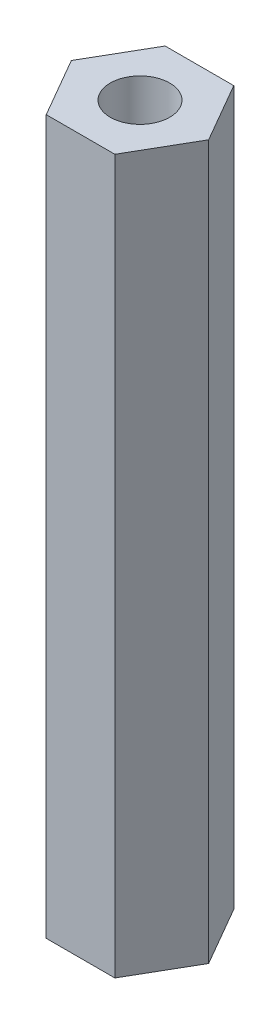
ISO-10303-21;
HEADER;
FILE_DESCRIPTION(('STEP AP214'),'2;1');
FILE_NAME('part.step','',(''),(''),'','','');
FILE_SCHEMA(('AUTOMOTIVE_DESIGN { 1 0 10303 214 1 1 1 1 }'));
ENDSEC;
DATA;
#1=APPLICATION_CONTEXT('core data for automotive mechanical design processes');
#2=APPLICATION_PROTOCOL_DEFINITION('international standard','automotive_design',2000,#1);
#3=PRODUCT_CONTEXT('',#1,'mechanical');
#4=PRODUCT('Part','Part','',(#3));
#5=PRODUCT_RELATED_PRODUCT_CATEGORY('part','',(#4));
#6=PRODUCT_DEFINITION_FORMATION('','',#4);
#7=PRODUCT_DEFINITION_CONTEXT('part definition',#1,'design');
#8=PRODUCT_DEFINITION('design','',#6,#7);
#9=PRODUCT_DEFINITION_SHAPE('','',#8);
#10=(LENGTH_UNIT() NAMED_UNIT(*) SI_UNIT(.MILLI.,.METRE.));
#11=(NAMED_UNIT(*) PLANE_ANGLE_UNIT() SI_UNIT($,.RADIAN.));
#12=(NAMED_UNIT(*) SI_UNIT($,.STERADIAN.) SOLID_ANGLE_UNIT());
#13=UNCERTAINTY_MEASURE_WITH_UNIT(LENGTH_MEASURE(1.E-05),#10,'distance_accuracy_value','');
#14=(GEOMETRIC_REPRESENTATION_CONTEXT(3) GLOBAL_UNCERTAINTY_ASSIGNED_CONTEXT((#13)) GLOBAL_UNIT_ASSIGNED_CONTEXT((#10,
#11,#12)) REPRESENTATION_CONTEXT('',''));
#15=CARTESIAN_POINT('',(0.,0.,0.));
#16=DIRECTION('',(0.,0.,1.));
#17=DIRECTION('',(1.,0.,0.));
#18=AXIS2_PLACEMENT_3D('',#15,#16,#17);
#19=CARTESIAN_POINT('',(0.,38.1,0.));
#20=DIRECTION('',(0.,1.,0.));
#21=DIRECTION('',(0.,0.,1.));
#22=AXIS2_PLACEMENT_3D('',#19,#20,#21);
#23=PLANE('',#22);
#24=DIRECTION('',(1.,0.,0.));
#25=VECTOR('',#24,1.);
#26=CARTESIAN_POINT('',(-3.66617420935412,38.1,6.35));
#27=LINE('',#26,#25);
#28=CARTESIAN_POINT('',(-3.66617420935412,38.1,6.35));
#29=VERTEX_POINT('',#28);
#30=CARTESIAN_POINT('',(3.66617420935413,38.1,6.35));
#31=VERTEX_POINT('',#30);
#32=EDGE_CURVE('E130',#29,#31,#27,.T.);
#33=ORIENTED_EDGE('',*,*,#32,.T.);
#34=DIRECTION('',(0.5,0.,-0.866025403784439));
#35=VECTOR('',#34,1.);
#36=CARTESIAN_POINT('',(3.66617420935413,38.1,6.35));
#37=LINE('',#36,#35);
#38=CARTESIAN_POINT('',(7.33234841870825,38.1,0.));
#39=VERTEX_POINT('',#38);
#40=EDGE_CURVE('E88',#31,#39,#37,.T.);
#41=ORIENTED_EDGE('',*,*,#40,.T.);
#42=DIRECTION('',(-0.500000000000001,0.,-0.866025403784438));
#43=VECTOR('',#42,1.);
#44=CARTESIAN_POINT('',(7.33234841870825,38.1,0.));
#45=LINE('',#44,#43);
#46=CARTESIAN_POINT('',(3.66617420935412,38.1,-6.35));
#47=VERTEX_POINT('',#46);
#48=EDGE_CURVE('E101',#39,#47,#45,.T.);
#49=ORIENTED_EDGE('',*,*,#48,.T.);
#50=DIRECTION('',(-1.,0.,0.));
#51=VECTOR('',#50,1.);
#52=CARTESIAN_POINT('',(3.66617420935412,38.1,-6.35));
#53=LINE('',#52,#51);
#54=CARTESIAN_POINT('',(-3.66617420935413,38.1,-6.35));
#55=VERTEX_POINT('',#54);
#56=EDGE_CURVE('E95',#47,#55,#53,.T.);
#57=ORIENTED_EDGE('',*,*,#56,.T.);
#58=DIRECTION('',(-0.5,0.,0.866025403784439));
#59=VECTOR('',#58,1.);
#60=CARTESIAN_POINT('',(-3.66617420935413,38.1,-6.35));
#61=LINE('',#60,#59);
#62=CARTESIAN_POINT('',(-7.33234841870825,38.1,0.));
#63=VERTEX_POINT('',#62);
#64=EDGE_CURVE('E99',#55,#63,#61,.T.);
#65=ORIENTED_EDGE('',*,*,#64,.T.);
#66=DIRECTION('',(0.5,0.,0.866025403784438));
#67=VECTOR('',#66,1.);
#68=CARTESIAN_POINT('',(-7.33234841870825,38.1,0.));
#69=LINE('',#68,#67);
#70=EDGE_CURVE('E51',#63,#29,#69,.T.);
#71=ORIENTED_EDGE('',*,*,#70,.T.);
#72=EDGE_LOOP('',(#33,#41,#49,#57,#65,#71));
#73=FACE_BOUND('',#72,.T.);
#74=CARTESIAN_POINT('',(0.,38.1,0.));
#75=DIRECTION('',(0.,1.,0.));
#76=DIRECTION('',(0.,0.,1.));
#77=AXIS2_PLACEMENT_3D('',#74,#75,#76);
#78=CIRCLE('',#77,3.175);
#79=CARTESIAN_POINT('',(0.,38.1,3.175));
#80=VERTEX_POINT('',#79);
#81=EDGE_CURVE('E123',#80,#80,#78,.T.);
#82=ORIENTED_EDGE('',*,*,#81,.F.);
#83=EDGE_LOOP('',(#82));
#84=FACE_BOUND('',#83,.T.);
#85=ADVANCED_FACE('F34',(#73,#84),#23,.T.);
#86=CARTESIAN_POINT('',(0.,-38.1,0.));
#87=DIRECTION('',(0.,1.,0.));
#88=DIRECTION('',(0.,0.,1.));
#89=AXIS2_PLACEMENT_3D('',#86,#87,#88);
#90=PLANE('',#89);
#91=DIRECTION('',(1.,0.,0.));
#92=VECTOR('',#91,1.);
#93=CARTESIAN_POINT('',(-3.66617420935412,-38.1,6.35));
#94=LINE('',#93,#92);
#95=CARTESIAN_POINT('',(-3.66617420935412,-38.1,6.35));
#96=VERTEX_POINT('',#95);
#97=CARTESIAN_POINT('',(3.66617420935413,-38.1,6.35));
#98=VERTEX_POINT('',#97);
#99=EDGE_CURVE('E119',#96,#98,#94,.T.);
#100=ORIENTED_EDGE('',*,*,#99,.F.);
#101=DIRECTION('',(0.5,0.,0.866025403784438));
#102=VECTOR('',#101,1.);
#103=CARTESIAN_POINT('',(-7.33234841870825,-38.1,0.));
#104=LINE('',#103,#102);
#105=CARTESIAN_POINT('',(-7.33234841870825,-38.1,0.));
#106=VERTEX_POINT('',#105);
#107=EDGE_CURVE('E80',#106,#96,#104,.T.);
#108=ORIENTED_EDGE('',*,*,#107,.F.);
#109=DIRECTION('',(-0.5,0.,0.866025403784439));
#110=VECTOR('',#109,1.);
#111=CARTESIAN_POINT('',(-3.66617420935413,-38.1,-6.35));
#112=LINE('',#111,#110);
#113=CARTESIAN_POINT('',(-3.66617420935413,-38.1,-6.35));
#114=VERTEX_POINT('',#113);
#115=EDGE_CURVE('E74',#114,#106,#112,.T.);
#116=ORIENTED_EDGE('',*,*,#115,.F.);
#117=DIRECTION('',(-1.,0.,0.));
#118=VECTOR('',#117,1.);
#119=CARTESIAN_POINT('',(3.66617420935412,-38.1,-6.35));
#120=LINE('',#119,#118);
#121=CARTESIAN_POINT('',(3.66617420935412,-38.1,-6.35));
#122=VERTEX_POINT('',#121);
#123=EDGE_CURVE('E109',#122,#114,#120,.T.);
#124=ORIENTED_EDGE('',*,*,#123,.F.);
#125=DIRECTION('',(-0.500000000000001,0.,-0.866025403784438));
#126=VECTOR('',#125,1.);
#127=CARTESIAN_POINT('',(7.33234841870825,-38.1,0.));
#128=LINE('',#127,#126);
#129=CARTESIAN_POINT('',(7.33234841870825,-38.1,0.));
#130=VERTEX_POINT('',#129);
#131=EDGE_CURVE('E125',#130,#122,#128,.T.);
#132=ORIENTED_EDGE('',*,*,#131,.F.);
#133=DIRECTION('',(0.5,0.,-0.866025403784439));
#134=VECTOR('',#133,1.);
#135=CARTESIAN_POINT('',(3.66617420935413,-38.1,6.35));
#136=LINE('',#135,#134);
#137=EDGE_CURVE('E122',#98,#130,#136,.T.);
#138=ORIENTED_EDGE('',*,*,#137,.F.);
#139=EDGE_LOOP('',(#100,#108,#116,#124,#132,#138));
#140=FACE_BOUND('',#139,.T.);
#141=CARTESIAN_POINT('',(0.,-38.1,0.));
#142=DIRECTION('',(0.,1.,0.));
#143=DIRECTION('',(0.,0.,1.));
#144=AXIS2_PLACEMENT_3D('',#141,#142,#143);
#145=CIRCLE('',#144,3.175);
#146=CARTESIAN_POINT('',(0.,-38.1,3.175));
#147=VERTEX_POINT('',#146);
#148=EDGE_CURVE('E223',#147,#147,#145,.T.);
#149=ORIENTED_EDGE('',*,*,#148,.T.);
#150=EDGE_LOOP('',(#149));
#151=FACE_BOUND('',#150,.T.);
#152=ADVANCED_FACE('F139',(#140,#151),#90,.F.);
#153=CARTESIAN_POINT('',(-3.66617420935412,38.1,6.35));
#154=DIRECTION('',(0.,0.,-1.));
#155=DIRECTION('',(-1.,0.,0.));
#156=AXIS2_PLACEMENT_3D('',#153,#154,#155);
#157=PLANE('',#156);
#158=ORIENTED_EDGE('',*,*,#99,.T.);
#159=DIRECTION('',(0.,-1.,0.));
#160=VECTOR('',#159,1.);
#161=CARTESIAN_POINT('',(3.66617420935413,38.1,6.35));
#162=LINE('',#161,#160);
#163=EDGE_CURVE('E11',#31,#98,#162,.T.);
#164=ORIENTED_EDGE('',*,*,#163,.F.);
#165=ORIENTED_EDGE('',*,*,#32,.F.);
#166=DIRECTION('',(0.,-1.,0.));
#167=VECTOR('',#166,1.);
#168=CARTESIAN_POINT('',(-3.66617420935412,38.1,6.35));
#169=LINE('',#168,#167);
#170=EDGE_CURVE('E115',#29,#96,#169,.T.);
#171=ORIENTED_EDGE('',*,*,#170,.T.);
#172=EDGE_LOOP('',(#158,#164,#165,#171));
#173=FACE_BOUND('',#172,.T.);
#174=ADVANCED_FACE('F36',(#173),#157,.F.);
#175=CARTESIAN_POINT('',(3.66617420935413,38.1,6.35));
#176=DIRECTION('',(-0.866025403784439,0.,-0.5));
#177=DIRECTION('',(-0.5,0.,0.866025403784439));
#178=AXIS2_PLACEMENT_3D('',#175,#176,#177);
#179=PLANE('',#178);
#180=ORIENTED_EDGE('',*,*,#137,.T.);
#181=DIRECTION('',(0.,-1.,0.));
#182=VECTOR('',#181,1.);
#183=CARTESIAN_POINT('',(7.33234841870825,38.1,0.));
#184=LINE('',#183,#182);
#185=EDGE_CURVE('E43',#39,#130,#184,.T.);
#186=ORIENTED_EDGE('',*,*,#185,.F.);
#187=ORIENTED_EDGE('',*,*,#40,.F.);
#188=ORIENTED_EDGE('',*,*,#163,.T.);
#189=EDGE_LOOP('',(#180,#186,#187,#188));
#190=FACE_BOUND('',#189,.T.);
#191=ADVANCED_FACE('F164',(#190),#179,.F.);
#192=CARTESIAN_POINT('',(7.33234841870825,38.1,0.));
#193=DIRECTION('',(-0.866025403784438,0.,0.500000000000001));
#194=DIRECTION('',(0.500000000000001,0.,0.866025403784438));
#195=AXIS2_PLACEMENT_3D('',#192,#193,#194);
#196=PLANE('',#195);
#197=ORIENTED_EDGE('',*,*,#131,.T.);
#198=DIRECTION('',(0.,-1.,0.));
#199=VECTOR('',#198,1.);
#200=CARTESIAN_POINT('',(3.66617420935412,38.1,-6.35));
#201=LINE('',#200,#199);
#202=EDGE_CURVE('E110',#47,#122,#201,.T.);
#203=ORIENTED_EDGE('',*,*,#202,.F.);
#204=ORIENTED_EDGE('',*,*,#48,.F.);
#205=ORIENTED_EDGE('',*,*,#185,.T.);
#206=EDGE_LOOP('',(#197,#203,#204,#205));
#207=FACE_BOUND('',#206,.T.);
#208=ADVANCED_FACE('F136',(#207),#196,.F.);
#209=CARTESIAN_POINT('',(3.66617420935412,38.1,-6.35));
#210=DIRECTION('',(0.,0.,1.));
#211=DIRECTION('',(1.,0.,0.));
#212=AXIS2_PLACEMENT_3D('',#209,#210,#211);
#213=PLANE('',#212);
#214=ORIENTED_EDGE('',*,*,#123,.T.);
#215=DIRECTION('',(0.,-1.,0.));
#216=VECTOR('',#215,1.);
#217=CARTESIAN_POINT('',(-3.66617420935413,38.1,-6.35));
#218=LINE('',#217,#216);
#219=EDGE_CURVE('E106',#55,#114,#218,.T.);
#220=ORIENTED_EDGE('',*,*,#219,.F.);
#221=ORIENTED_EDGE('',*,*,#56,.F.);
#222=ORIENTED_EDGE('',*,*,#202,.T.);
#223=EDGE_LOOP('',(#214,#220,#221,#222));
#224=FACE_BOUND('',#223,.T.);
#225=ADVANCED_FACE('F107',(#224),#213,.F.);
#226=CARTESIAN_POINT('',(-3.66617420935413,38.1,-6.35));
#227=DIRECTION('',(0.866025403784439,0.,0.5));
#228=DIRECTION('',(0.5,0.,-0.866025403784439));
#229=AXIS2_PLACEMENT_3D('',#226,#227,#228);
#230=PLANE('',#229);
#231=ORIENTED_EDGE('',*,*,#115,.T.);
#232=DIRECTION('',(0.,-1.,0.));
#233=VECTOR('',#232,1.);
#234=CARTESIAN_POINT('',(-7.33234841870825,38.1,0.));
#235=LINE('',#234,#233);
#236=EDGE_CURVE('E111',#63,#106,#235,.T.);
#237=ORIENTED_EDGE('',*,*,#236,.F.);
#238=ORIENTED_EDGE('',*,*,#64,.F.);
#239=ORIENTED_EDGE('',*,*,#219,.T.);
#240=EDGE_LOOP('',(#231,#237,#238,#239));
#241=FACE_BOUND('',#240,.T.);
#242=ADVANCED_FACE('F113',(#241),#230,.F.);
#243=CARTESIAN_POINT('',(-7.33234841870825,38.1,0.));
#244=DIRECTION('',(0.866025403784438,0.,-0.500000000000001));
#245=DIRECTION('',(-0.500000000000001,0.,-0.866025403784438));
#246=AXIS2_PLACEMENT_3D('',#243,#244,#245);
#247=PLANE('',#246);
#248=ORIENTED_EDGE('',*,*,#107,.T.);
#249=ORIENTED_EDGE('',*,*,#170,.F.);
#250=ORIENTED_EDGE('',*,*,#70,.F.);
#251=ORIENTED_EDGE('',*,*,#236,.T.);
#252=EDGE_LOOP('',(#248,#249,#250,#251));
#253=FACE_BOUND('',#252,.T.);
#254=ADVANCED_FACE('F144',(#253),#247,.F.);
#255=CARTESIAN_POINT('',(0.,38.1,0.));
#256=DIRECTION('',(0.,-1.,0.));
#257=DIRECTION('',(0.,0.,-1.));
#258=AXIS2_PLACEMENT_3D('',#255,#256,#257);
#259=CYLINDRICAL_SURFACE('',#258,3.175);
#260=ORIENTED_EDGE('',*,*,#81,.T.);
#261=EDGE_LOOP('',(#260));
#262=FACE_BOUND('',#261,.T.);
#263=ORIENTED_EDGE('',*,*,#148,.F.);
#264=EDGE_LOOP('',(#263));
#265=FACE_BOUND('',#264,.T.);
#266=ADVANCED_FACE('F146',(#262,#265),#259,.F.);
#267=CLOSED_SHELL('',(#85,#152,#174,#191,#208,#225,#242,#254,#266));
#268=MANIFOLD_SOLID_BREP('B2',#267);
#269=ADVANCED_BREP_SHAPE_REPRESENTATION('',(#18,#268),#14);
#270=SHAPE_DEFINITION_REPRESENTATION(#9,#269);
ENDSEC;
END-ISO-10303-21;
